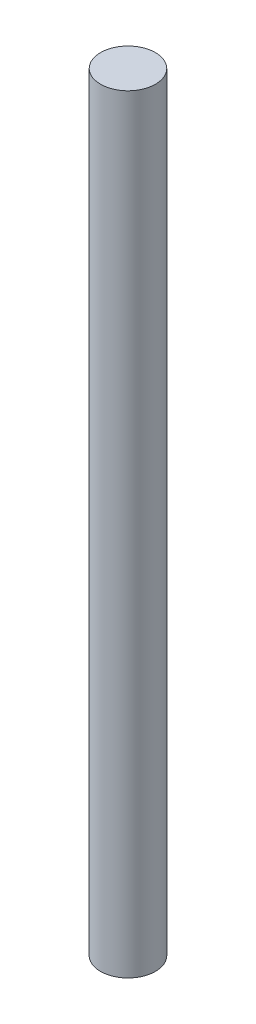
ISO-10303-21;
HEADER;
FILE_DESCRIPTION(('STEP AP214'),'2;1');
FILE_NAME('part.step','',(''),(''),'','','');
FILE_SCHEMA(('AUTOMOTIVE_DESIGN { 1 0 10303 214 1 1 1 1 }'));
ENDSEC;
DATA;
#1=APPLICATION_CONTEXT('core data for automotive mechanical design processes');
#2=APPLICATION_PROTOCOL_DEFINITION('international standard','automotive_design',2000,#1);
#3=PRODUCT_CONTEXT('',#1,'mechanical');
#4=PRODUCT('Part','Part','',(#3));
#5=PRODUCT_RELATED_PRODUCT_CATEGORY('part','',(#4));
#6=PRODUCT_DEFINITION_FORMATION('','',#4);
#7=PRODUCT_DEFINITION_CONTEXT('part definition',#1,'design');
#8=PRODUCT_DEFINITION('design','',#6,#7);
#9=PRODUCT_DEFINITION_SHAPE('','',#8);
#10=(LENGTH_UNIT() NAMED_UNIT(*) SI_UNIT(.MILLI.,.METRE.));
#11=(NAMED_UNIT(*) PLANE_ANGLE_UNIT() SI_UNIT($,.RADIAN.));
#12=(NAMED_UNIT(*) SI_UNIT($,.STERADIAN.) SOLID_ANGLE_UNIT());
#13=UNCERTAINTY_MEASURE_WITH_UNIT(LENGTH_MEASURE(1.E-05),#10,'distance_accuracy_value','');
#14=(GEOMETRIC_REPRESENTATION_CONTEXT(3) GLOBAL_UNCERTAINTY_ASSIGNED_CONTEXT((#13)) GLOBAL_UNIT_ASSIGNED_CONTEXT((#10,
#11,#12)) REPRESENTATION_CONTEXT('',''));
#15=CARTESIAN_POINT('',(0.,0.,0.));
#16=DIRECTION('',(0.,0.,1.));
#17=DIRECTION('',(1.,0.,0.));
#18=AXIS2_PLACEMENT_3D('',#15,#16,#17);
#19=CARTESIAN_POINT('',(0.,88.9,0.));
#20=DIRECTION('',(0.,-1.,0.));
#21=DIRECTION('',(0.,0.,-1.));
#22=AXIS2_PLACEMENT_3D('',#19,#20,#21);
#23=CYLINDRICAL_SURFACE('',#22,3.175);
#24=CARTESIAN_POINT('',(0.,88.9,0.));
#25=DIRECTION('',(0.,1.,0.));
#26=DIRECTION('',(0.,0.,1.));
#27=AXIS2_PLACEMENT_3D('',#24,#25,#26);
#28=CIRCLE('',#27,3.175);
#29=CARTESIAN_POINT('',(0.,88.9,3.175));
#30=VERTEX_POINT('',#29);
#31=EDGE_CURVE('E11',#30,#30,#28,.T.);
#32=ORIENTED_EDGE('',*,*,#31,.F.);
#33=EDGE_LOOP('',(#32));
#34=FACE_BOUND('',#33,.T.);
#35=CARTESIAN_POINT('',(0.,0.,0.));
#36=DIRECTION('',(0.,1.,0.));
#37=DIRECTION('',(0.,0.,1.));
#38=AXIS2_PLACEMENT_3D('',#35,#36,#37);
#39=CIRCLE('',#38,3.175);
#40=CARTESIAN_POINT('',(0.,0.,3.175));
#41=VERTEX_POINT('',#40);
#42=EDGE_CURVE('E44',#41,#41,#39,.T.);
#43=ORIENTED_EDGE('',*,*,#42,.T.);
#44=EDGE_LOOP('',(#43));
#45=FACE_BOUND('',#44,.T.);
#46=ADVANCED_FACE('F40',(#34,#45),#23,.T.);
#47=CARTESIAN_POINT('',(0.,88.9,0.));
#48=DIRECTION('',(0.,1.,0.));
#49=DIRECTION('',(0.,0.,1.));
#50=AXIS2_PLACEMENT_3D('',#47,#48,#49);
#51=PLANE('',#50);
#52=ORIENTED_EDGE('',*,*,#31,.T.);
#53=EDGE_LOOP('',(#52));
#54=FACE_BOUND('',#53,.T.);
#55=ADVANCED_FACE('F63',(#54),#51,.T.);
#56=CARTESIAN_POINT('',(0.,0.,0.));
#57=DIRECTION('',(0.,1.,0.));
#58=DIRECTION('',(0.,0.,1.));
#59=AXIS2_PLACEMENT_3D('',#56,#57,#58);
#60=PLANE('',#59);
#61=ORIENTED_EDGE('',*,*,#42,.F.);
#62=EDGE_LOOP('',(#61));
#63=FACE_BOUND('',#62,.T.);
#64=ADVANCED_FACE('F61',(#63),#60,.F.);
#65=CLOSED_SHELL('',(#46,#55,#64));
#66=MANIFOLD_SOLID_BREP('B2',#65);
#67=ADVANCED_BREP_SHAPE_REPRESENTATION('',(#18,#66),#14);
#68=SHAPE_DEFINITION_REPRESENTATION(#9,#67);
ENDSEC;
END-ISO-10303-21;
